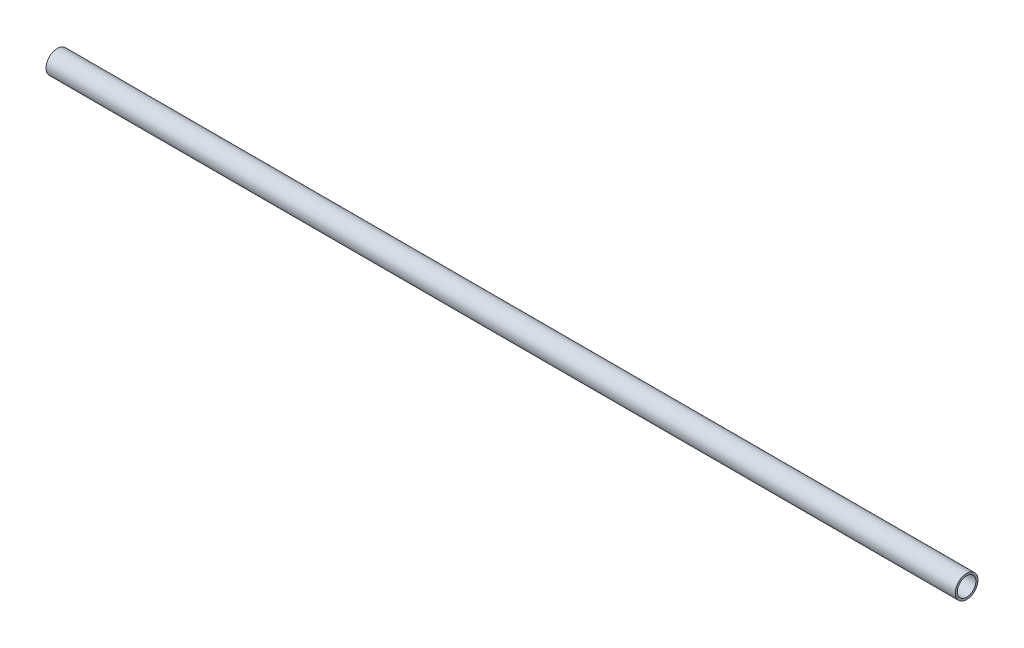
ISO-10303-21;
HEADER;
FILE_DESCRIPTION(('STEP AP214'),'2;1');
FILE_NAME('part.step','',(''),(''),'','','');
FILE_SCHEMA(('AUTOMOTIVE_DESIGN { 1 0 10303 214 1 1 1 1 }'));
ENDSEC;
DATA;
#1=APPLICATION_CONTEXT('core data for automotive mechanical design processes');
#2=APPLICATION_PROTOCOL_DEFINITION('international standard','automotive_design',2000,#1);
#3=PRODUCT_CONTEXT('',#1,'mechanical');
#4=PRODUCT('Part','Part','',(#3));
#5=PRODUCT_RELATED_PRODUCT_CATEGORY('part','',(#4));
#6=PRODUCT_DEFINITION_FORMATION('','',#4);
#7=PRODUCT_DEFINITION_CONTEXT('part definition',#1,'design');
#8=PRODUCT_DEFINITION('design','',#6,#7);
#9=PRODUCT_DEFINITION_SHAPE('','',#8);
#10=(LENGTH_UNIT() NAMED_UNIT(*) SI_UNIT(.MILLI.,.METRE.));
#11=(NAMED_UNIT(*) PLANE_ANGLE_UNIT() SI_UNIT($,.RADIAN.));
#12=(NAMED_UNIT(*) SI_UNIT($,.STERADIAN.) SOLID_ANGLE_UNIT());
#13=UNCERTAINTY_MEASURE_WITH_UNIT(LENGTH_MEASURE(1.E-05),#10,'distance_accuracy_value','');
#14=(GEOMETRIC_REPRESENTATION_CONTEXT(3) GLOBAL_UNCERTAINTY_ASSIGNED_CONTEXT((#13)) GLOBAL_UNIT_ASSIGNED_CONTEXT((#10,
#11,#12)) REPRESENTATION_CONTEXT('',''));
#15=CARTESIAN_POINT('',(0.,0.,0.));
#16=DIRECTION('',(0.,0.,1.));
#17=DIRECTION('',(1.,0.,0.));
#18=AXIS2_PLACEMENT_3D('',#15,#16,#17);
#19=CARTESIAN_POINT('',(0.,0.,0.));
#20=DIRECTION('',(1.,0.,0.));
#21=DIRECTION('',(0.,0.,-1.));
#22=AXIS2_PLACEMENT_3D('',#19,#20,#21);
#23=CYLINDRICAL_SURFACE('',#22,51.1);
#24=CARTESIAN_POINT('',(0.,0.,0.));
#25=DIRECTION('',(1.,0.,0.));
#26=DIRECTION('',(0.,0.,-1.));
#27=AXIS2_PLACEMENT_3D('',#24,#25,#26);
#28=CIRCLE('',#27,51.1);
#29=CARTESIAN_POINT('',(0.,0.,-51.1));
#30=VERTEX_POINT('',#29);
#31=EDGE_CURVE('E16',#30,#30,#28,.T.);
#32=ORIENTED_EDGE('',*,*,#31,.F.);
#33=EDGE_LOOP('',(#32));
#34=FACE_BOUND('',#33,.T.);
#35=CARTESIAN_POINT('',(5000.,0.,0.));
#36=DIRECTION('',(1.,0.,0.));
#37=DIRECTION('',(0.,0.,-1.));
#38=AXIS2_PLACEMENT_3D('',#35,#36,#37);
#39=CIRCLE('',#38,51.1);
#40=CARTESIAN_POINT('',(5000.,0.,-51.1));
#41=VERTEX_POINT('',#40);
#42=EDGE_CURVE('E25',#41,#41,#39,.F.);
#43=ORIENTED_EDGE('',*,*,#42,.F.);
#44=EDGE_LOOP('',(#43));
#45=FACE_BOUND('',#44,.T.);
#46=ADVANCED_FACE('F13',(#34,#45),#23,.F.);
#47=CARTESIAN_POINT('',(0.,-63.2500021083603,-62.5));
#48=DIRECTION('',(-1.,0.,0.));
#49=DIRECTION('',(0.,0.,1.));
#50=AXIS2_PLACEMENT_3D('',#47,#48,#49);
#51=PLANE('',#50);
#52=ORIENTED_EDGE('',*,*,#31,.T.);
#53=EDGE_LOOP('',(#52));
#54=FACE_BOUND('',#53,.T.);
#55=CARTESIAN_POINT('',(0.,0.,0.));
#56=DIRECTION('',(1.,0.,0.));
#57=DIRECTION('',(0.,0.,-1.));
#58=AXIS2_PLACEMENT_3D('',#55,#56,#57);
#59=CIRCLE('',#58,62.5);
#60=CARTESIAN_POINT('',(0.,0.,-62.5));
#61=VERTEX_POINT('',#60);
#62=EDGE_CURVE('E20',#61,#61,#59,.T.);
#63=ORIENTED_EDGE('',*,*,#62,.F.);
#64=EDGE_LOOP('',(#63));
#65=FACE_BOUND('',#64,.T.);
#66=ADVANCED_FACE('F33',(#54,#65),#51,.T.);
#67=CARTESIAN_POINT('',(5000.,-63.2500021083616,62.5));
#68=DIRECTION('',(1.,0.,0.));
#69=DIRECTION('',(0.,0.,-1.));
#70=AXIS2_PLACEMENT_3D('',#67,#68,#69);
#71=PLANE('',#70);
#72=ORIENTED_EDGE('',*,*,#42,.T.);
#73=EDGE_LOOP('',(#72));
#74=FACE_BOUND('',#73,.T.);
#75=CARTESIAN_POINT('',(5000.,0.,0.));
#76=DIRECTION('',(1.,0.,0.));
#77=DIRECTION('',(0.,0.,-1.));
#78=AXIS2_PLACEMENT_3D('',#75,#76,#77);
#79=CIRCLE('',#78,62.5);
#80=CARTESIAN_POINT('',(5000.,0.,-62.5));
#81=VERTEX_POINT('',#80);
#82=EDGE_CURVE('E8',#81,#81,#79,.F.);
#83=ORIENTED_EDGE('',*,*,#82,.F.);
#84=EDGE_LOOP('',(#83));
#85=FACE_BOUND('',#84,.T.);
#86=ADVANCED_FACE('F42',(#74,#85),#71,.T.);
#87=CARTESIAN_POINT('',(5000.,0.,0.));
#88=DIRECTION('',(1.,0.,0.));
#89=DIRECTION('',(0.,0.,-1.));
#90=AXIS2_PLACEMENT_3D('',#87,#88,#89);
#91=CYLINDRICAL_SURFACE('',#90,62.5);
#92=ORIENTED_EDGE('',*,*,#62,.T.);
#93=EDGE_LOOP('',(#92));
#94=FACE_BOUND('',#93,.T.);
#95=ORIENTED_EDGE('',*,*,#82,.T.);
#96=EDGE_LOOP('',(#95));
#97=FACE_BOUND('',#96,.T.);
#98=ADVANCED_FACE('F43',(#94,#97),#91,.T.);
#99=CLOSED_SHELL('',(#46,#66,#86,#98));
#100=MANIFOLD_SOLID_BREP('B1',#99);
#101=ADVANCED_BREP_SHAPE_REPRESENTATION('',(#18,#100),#14);
#102=SHAPE_DEFINITION_REPRESENTATION(#9,#101);
ENDSEC;
END-ISO-10303-21;
